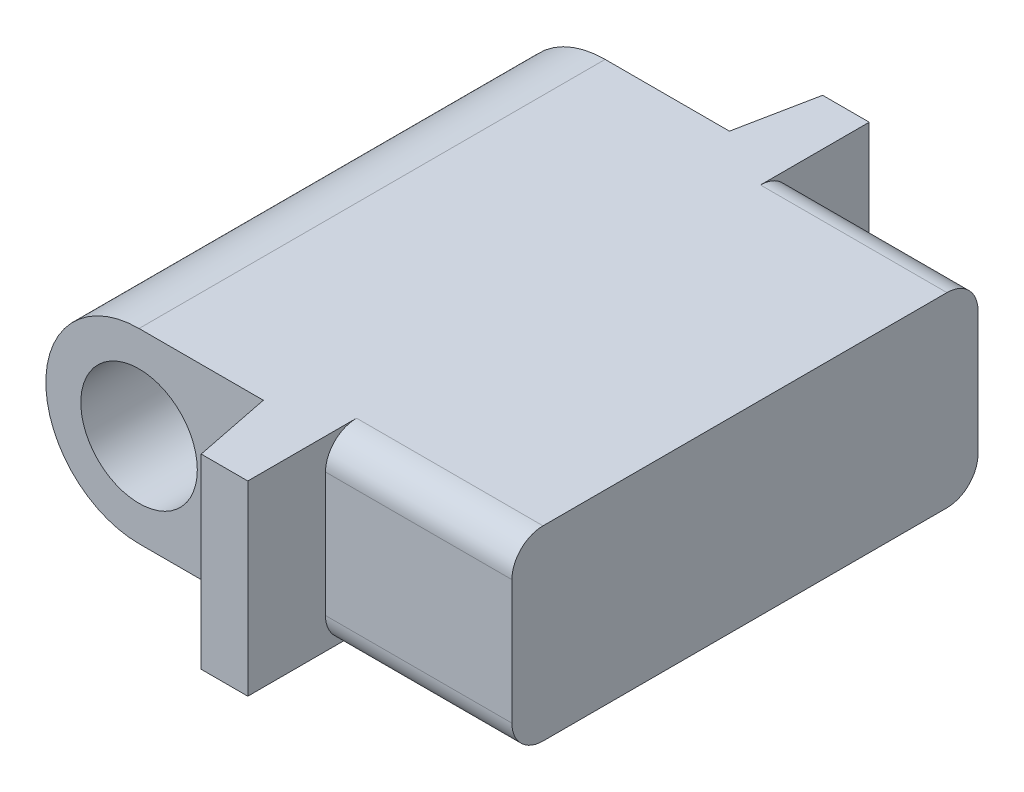
ISO-10303-21;
HEADER;
FILE_DESCRIPTION(('STEP AP214'),'2;1');
FILE_NAME('part.step','',(''),(''),'','','');
FILE_SCHEMA(('AUTOMOTIVE_DESIGN { 1 0 10303 214 1 1 1 1 }'));
ENDSEC;
DATA;
#1=APPLICATION_CONTEXT('core data for automotive mechanical design processes');
#2=APPLICATION_PROTOCOL_DEFINITION('international standard','automotive_design',2000,#1);
#3=PRODUCT_CONTEXT('',#1,'mechanical');
#4=PRODUCT('Part','Part','',(#3));
#5=PRODUCT_RELATED_PRODUCT_CATEGORY('part','',(#4));
#6=PRODUCT_DEFINITION_FORMATION('','',#4);
#7=PRODUCT_DEFINITION_CONTEXT('part definition',#1,'design');
#8=PRODUCT_DEFINITION('design','',#6,#7);
#9=PRODUCT_DEFINITION_SHAPE('','',#8);
#10=(LENGTH_UNIT() NAMED_UNIT(*) SI_UNIT(.MILLI.,.METRE.));
#11=(NAMED_UNIT(*) PLANE_ANGLE_UNIT() SI_UNIT($,.RADIAN.));
#12=(NAMED_UNIT(*) SI_UNIT($,.STERADIAN.) SOLID_ANGLE_UNIT());
#13=UNCERTAINTY_MEASURE_WITH_UNIT(LENGTH_MEASURE(1.E-05),#10,'distance_accuracy_value','');
#14=(GEOMETRIC_REPRESENTATION_CONTEXT(3) GLOBAL_UNCERTAINTY_ASSIGNED_CONTEXT((#13)) GLOBAL_UNIT_ASSIGNED_CONTEXT((#10,
#11,#12)) REPRESENTATION_CONTEXT('',''));
#15=CARTESIAN_POINT('',(0.,0.,0.));
#16=DIRECTION('',(0.,0.,1.));
#17=DIRECTION('',(1.,0.,0.));
#18=AXIS2_PLACEMENT_3D('',#15,#16,#17);
#19=CARTESIAN_POINT('',(0.,0.,19.05));
#20=DIRECTION('',(0.,0.,1.));
#21=DIRECTION('',(1.,0.,0.));
#22=AXIS2_PLACEMENT_3D('',#19,#20,#21);
#23=PLANE('',#22);
#24=CARTESIAN_POINT('',(-11.43,7.62,19.05));
#25=DIRECTION('',(0.,0.,1.));
#26=DIRECTION('',(1.,0.,0.));
#27=AXIS2_PLACEMENT_3D('',#24,#25,#26);
#28=CIRCLE('',#27,4.7625);
#29=CARTESIAN_POINT('',(-6.6675,7.62,19.05));
#30=VERTEX_POINT('',#29);
#31=EDGE_CURVE('E292',#30,#30,#28,.T.);
#32=ORIENTED_EDGE('',*,*,#31,.F.);
#33=EDGE_LOOP('',(#32));
#34=FACE_BOUND('',#33,.T.);
#35=CARTESIAN_POINT('',(-11.43,7.62,19.05));
#36=DIRECTION('',(0.,0.,1.));
#37=DIRECTION('',(1.,0.,0.));
#38=AXIS2_PLACEMENT_3D('',#35,#36,#37);
#39=CIRCLE('',#38,7.62);
#40=CARTESIAN_POINT('',(-11.43,15.24,19.05));
#41=VERTEX_POINT('',#40);
#42=CARTESIAN_POINT('',(-11.43,0.,19.05));
#43=VERTEX_POINT('',#42);
#44=EDGE_CURVE('E176',#41,#43,#39,.T.);
#45=ORIENTED_EDGE('',*,*,#44,.T.);
#46=DIRECTION('',(1.,0.,0.));
#47=VECTOR('',#46,1.);
#48=CARTESIAN_POINT('',(0.,0.,19.05));
#49=LINE('',#48,#47);
#50=CARTESIAN_POINT('',(-1.27000000000001,0.,19.05));
#51=VERTEX_POINT('',#50);
#52=EDGE_CURVE('E180',#43,#51,#49,.T.);
#53=ORIENTED_EDGE('',*,*,#52,.T.);
#54=DIRECTION('',(0.,1.,0.));
#55=VECTOR('',#54,1.);
#56=CARTESIAN_POINT('',(-1.27000000000001,0.,19.05));
#57=LINE('',#56,#55);
#58=CARTESIAN_POINT('',(-1.27000000000001,15.24,19.05));
#59=VERTEX_POINT('',#58);
#60=EDGE_CURVE('E219',#51,#59,#57,.T.);
#61=ORIENTED_EDGE('',*,*,#60,.T.);
#62=DIRECTION('',(1.,0.,0.));
#63=VECTOR('',#62,1.);
#64=CARTESIAN_POINT('',(0.,15.24,19.05));
#65=LINE('',#64,#63);
#66=EDGE_CURVE('E182',#41,#59,#65,.T.);
#67=ORIENTED_EDGE('',*,*,#66,.F.);
#68=EDGE_LOOP('',(#45,#53,#61,#67));
#69=FACE_BOUND('',#68,.T.);
#70=ADVANCED_FACE('F63',(#34,#69),#23,.T.);
#71=CARTESIAN_POINT('',(0.,0.,-19.05));
#72=DIRECTION('',(0.,0.,1.));
#73=DIRECTION('',(1.,0.,0.));
#74=AXIS2_PLACEMENT_3D('',#71,#72,#73);
#75=PLANE('',#74);
#76=CARTESIAN_POINT('',(-11.43,7.62,-19.05));
#77=DIRECTION('',(0.,0.,1.));
#78=DIRECTION('',(1.,0.,0.));
#79=AXIS2_PLACEMENT_3D('',#76,#77,#78);
#80=CIRCLE('',#79,4.7625);
#81=CARTESIAN_POINT('',(-6.6675,7.62,-19.05));
#82=VERTEX_POINT('',#81);
#83=EDGE_CURVE('E187',#82,#82,#80,.T.);
#84=ORIENTED_EDGE('',*,*,#83,.T.);
#85=EDGE_LOOP('',(#84));
#86=FACE_BOUND('',#85,.T.);
#87=DIRECTION('',(1.,0.,0.));
#88=VECTOR('',#87,1.);
#89=CARTESIAN_POINT('',(0.,0.,-19.05));
#90=LINE('',#89,#88);
#91=CARTESIAN_POINT('',(-11.43,0.,-19.05));
#92=VERTEX_POINT('',#91);
#93=CARTESIAN_POINT('',(-1.27000000000001,0.,-19.05));
#94=VERTEX_POINT('',#93);
#95=EDGE_CURVE('E225',#92,#94,#90,.T.);
#96=ORIENTED_EDGE('',*,*,#95,.F.);
#97=CARTESIAN_POINT('',(-11.43,7.62,-19.05));
#98=DIRECTION('',(0.,0.,1.));
#99=DIRECTION('',(1.,0.,0.));
#100=AXIS2_PLACEMENT_3D('',#97,#98,#99);
#101=CIRCLE('',#100,7.62);
#102=CARTESIAN_POINT('',(-11.43,15.24,-19.05));
#103=VERTEX_POINT('',#102);
#104=EDGE_CURVE('E193',#103,#92,#101,.T.);
#105=ORIENTED_EDGE('',*,*,#104,.F.);
#106=DIRECTION('',(1.,0.,0.));
#107=VECTOR('',#106,1.);
#108=CARTESIAN_POINT('',(0.,15.24,-19.05));
#109=LINE('',#108,#107);
#110=CARTESIAN_POINT('',(-1.27000000000001,15.24,-19.05));
#111=VERTEX_POINT('',#110);
#112=EDGE_CURVE('E234',#103,#111,#109,.T.);
#113=ORIENTED_EDGE('',*,*,#112,.T.);
#114=DIRECTION('',(0.,1.,0.));
#115=VECTOR('',#114,1.);
#116=CARTESIAN_POINT('',(-1.27000000000001,0.,-19.05));
#117=LINE('',#116,#115);
#118=EDGE_CURVE('E233',#94,#111,#117,.T.);
#119=ORIENTED_EDGE('',*,*,#118,.F.);
#120=EDGE_LOOP('',(#96,#105,#113,#119));
#121=FACE_BOUND('',#120,.T.);
#122=ADVANCED_FACE('F363',(#86,#121),#75,.F.);
#123=CARTESIAN_POINT('',(0.,0.,0.));
#124=DIRECTION('',(0.,1.,0.));
#125=DIRECTION('',(0.,0.,1.));
#126=AXIS2_PLACEMENT_3D('',#123,#124,#125);
#127=PLANE('',#126);
#128=DIRECTION('',(0.,0.,1.));
#129=VECTOR('',#128,1.);
#130=CARTESIAN_POINT('',(3.81,0.,0.));
#131=LINE('',#130,#129);
#132=CARTESIAN_POINT('',(3.80999999999999,0.,-25.4));
#133=VERTEX_POINT('',#132);
#134=CARTESIAN_POINT('',(3.80999999999999,0.,-16.51));
#135=VERTEX_POINT('',#134);
#136=EDGE_CURVE('E245',#133,#135,#131,.T.);
#137=ORIENTED_EDGE('',*,*,#136,.T.);
#138=DIRECTION('',(1.,0.,0.));
#139=VECTOR('',#138,1.);
#140=CARTESIAN_POINT('',(0.,0.,-16.51));
#141=LINE('',#140,#139);
#142=CARTESIAN_POINT('',(19.05,0.,-16.51));
#143=VERTEX_POINT('',#142);
#144=EDGE_CURVE('E323',#135,#143,#141,.T.);
#145=ORIENTED_EDGE('',*,*,#144,.T.);
#146=DIRECTION('',(0.,0.,-1.));
#147=VECTOR('',#146,1.);
#148=CARTESIAN_POINT('',(19.05,0.,25.4));
#149=LINE('',#148,#147);
#150=CARTESIAN_POINT('',(19.05,0.,16.51));
#151=VERTEX_POINT('',#150);
#152=EDGE_CURVE('E280',#151,#143,#149,.T.);
#153=ORIENTED_EDGE('',*,*,#152,.F.);
#154=DIRECTION('',(1.,0.,0.));
#155=VECTOR('',#154,1.);
#156=CARTESIAN_POINT('',(3.80999999999998,0.,16.51));
#157=LINE('',#156,#155);
#158=CARTESIAN_POINT('',(3.80999999999999,0.,16.51));
#159=VERTEX_POINT('',#158);
#160=EDGE_CURVE('E319',#151,#159,#157,.F.);
#161=ORIENTED_EDGE('',*,*,#160,.T.);
#162=DIRECTION('',(0.,0.,-1.));
#163=VECTOR('',#162,1.);
#164=CARTESIAN_POINT('',(3.80999999999999,0.,0.));
#165=LINE('',#164,#163);
#166=CARTESIAN_POINT('',(3.80999999999999,0.,25.4));
#167=VERTEX_POINT('',#166);
#168=EDGE_CURVE('E347',#167,#159,#165,.T.);
#169=ORIENTED_EDGE('',*,*,#168,.F.);
#170=DIRECTION('',(1.,0.,0.));
#171=VECTOR('',#170,1.);
#172=CARTESIAN_POINT('',(19.05,0.,25.4));
#173=LINE('',#172,#171);
#174=CARTESIAN_POINT('',(0.,0.,25.4));
#175=VERTEX_POINT('',#174);
#176=EDGE_CURVE('E256',#175,#167,#173,.T.);
#177=ORIENTED_EDGE('',*,*,#176,.F.);
#178=DIRECTION('',(0.196116135138184,0.,0.98058067569092));
#179=VECTOR('',#178,1.);
#180=CARTESIAN_POINT('',(-4.8846153846154,0.,0.97692307692308));
#181=LINE('',#180,#179);
#182=EDGE_CURVE('E202',#51,#175,#181,.T.);
#183=ORIENTED_EDGE('',*,*,#182,.F.);
#184=ORIENTED_EDGE('',*,*,#52,.F.);
#185=DIRECTION('',(0.,0.,1.));
#186=VECTOR('',#185,1.);
#187=CARTESIAN_POINT('',(-11.43,0.,-25.4));
#188=LINE('',#187,#186);
#189=EDGE_CURVE('E190',#92,#43,#188,.T.);
#190=ORIENTED_EDGE('',*,*,#189,.F.);
#191=ORIENTED_EDGE('',*,*,#95,.T.);
#192=DIRECTION('',(0.196116135138184,0.,-0.98058067569092));
#193=VECTOR('',#192,1.);
#194=CARTESIAN_POINT('',(-4.88461538461539,0.,-0.976923076923078));
#195=LINE('',#194,#193);
#196=CARTESIAN_POINT('',(0.,0.,-25.4));
#197=VERTEX_POINT('',#196);
#198=EDGE_CURVE('E228',#94,#197,#195,.T.);
#199=ORIENTED_EDGE('',*,*,#198,.T.);
#200=DIRECTION('',(-1.,0.,0.));
#201=VECTOR('',#200,1.);
#202=CARTESIAN_POINT('',(19.05,0.,-25.4));
#203=LINE('',#202,#201);
#204=EDGE_CURVE('E269',#133,#197,#203,.T.);
#205=ORIENTED_EDGE('',*,*,#204,.F.);
#206=EDGE_LOOP('',(#137,#145,#153,#161,#169,#177,#183,#184,#190,#191,#199,#205));
#207=FACE_BOUND('',#206,.T.);
#208=ADVANCED_FACE('F200',(#207),#127,.F.);
#209=CARTESIAN_POINT('',(0.,15.24,0.));
#210=DIRECTION('',(0.,1.,0.));
#211=DIRECTION('',(0.,0.,1.));
#212=AXIS2_PLACEMENT_3D('',#209,#210,#211);
#213=PLANE('',#212);
#214=DIRECTION('',(0.,0.,-1.));
#215=VECTOR('',#214,1.);
#216=CARTESIAN_POINT('',(19.05,15.24,25.4));
#217=LINE('',#216,#215);
#218=CARTESIAN_POINT('',(19.05,15.24,16.51));
#219=VERTEX_POINT('',#218);
#220=CARTESIAN_POINT('',(19.05,15.24,-16.51));
#221=VERTEX_POINT('',#220);
#222=EDGE_CURVE('E268',#219,#221,#217,.T.);
#223=ORIENTED_EDGE('',*,*,#222,.T.);
#224=DIRECTION('',(1.,0.,0.));
#225=VECTOR('',#224,1.);
#226=CARTESIAN_POINT('',(3.80999999999999,15.24,-16.51));
#227=LINE('',#226,#225);
#228=CARTESIAN_POINT('',(3.80999999999999,15.24,-16.51));
#229=VERTEX_POINT('',#228);
#230=EDGE_CURVE('E315',#221,#229,#227,.F.);
#231=ORIENTED_EDGE('',*,*,#230,.T.);
#232=DIRECTION('',(0.,0.,1.));
#233=VECTOR('',#232,1.);
#234=CARTESIAN_POINT('',(3.81,15.24,0.));
#235=LINE('',#234,#233);
#236=CARTESIAN_POINT('',(3.80999999999999,15.24,-25.4));
#237=VERTEX_POINT('',#236);
#238=EDGE_CURVE('E249',#237,#229,#235,.T.);
#239=ORIENTED_EDGE('',*,*,#238,.F.);
#240=DIRECTION('',(-1.,0.,0.));
#241=VECTOR('',#240,1.);
#242=CARTESIAN_POINT('',(19.05,15.24,-25.4));
#243=LINE('',#242,#241);
#244=CARTESIAN_POINT('',(0.,15.24,-25.4));
#245=VERTEX_POINT('',#244);
#246=EDGE_CURVE('E273',#237,#245,#243,.T.);
#247=ORIENTED_EDGE('',*,*,#246,.T.);
#248=DIRECTION('',(0.196116135138184,0.,-0.98058067569092));
#249=VECTOR('',#248,1.);
#250=CARTESIAN_POINT('',(-4.88461538461539,15.24,-0.976923076923078));
#251=LINE('',#250,#249);
#252=EDGE_CURVE('E229',#111,#245,#251,.T.);
#253=ORIENTED_EDGE('',*,*,#252,.F.);
#254=ORIENTED_EDGE('',*,*,#112,.F.);
#255=DIRECTION('',(0.,0.,1.));
#256=VECTOR('',#255,1.);
#257=CARTESIAN_POINT('',(-11.43,15.24,-25.4));
#258=LINE('',#257,#256);
#259=EDGE_CURVE('E186',#103,#41,#258,.T.);
#260=ORIENTED_EDGE('',*,*,#259,.T.);
#261=ORIENTED_EDGE('',*,*,#66,.T.);
#262=DIRECTION('',(0.196116135138184,0.,0.98058067569092));
#263=VECTOR('',#262,1.);
#264=CARTESIAN_POINT('',(-4.8846153846154,15.24,0.97692307692308));
#265=LINE('',#264,#263);
#266=CARTESIAN_POINT('',(0.,15.24,25.4));
#267=VERTEX_POINT('',#266);
#268=EDGE_CURVE('E204',#59,#267,#265,.T.);
#269=ORIENTED_EDGE('',*,*,#268,.T.);
#270=DIRECTION('',(1.,0.,0.));
#271=VECTOR('',#270,1.);
#272=CARTESIAN_POINT('',(19.05,15.24,25.4));
#273=LINE('',#272,#271);
#274=CARTESIAN_POINT('',(3.80999999999999,15.24,25.4));
#275=VERTEX_POINT('',#274);
#276=EDGE_CURVE('E264',#267,#275,#273,.T.);
#277=ORIENTED_EDGE('',*,*,#276,.T.);
#278=DIRECTION('',(0.,0.,-1.));
#279=VECTOR('',#278,1.);
#280=CARTESIAN_POINT('',(3.80999999999999,15.24,0.));
#281=LINE('',#280,#279);
#282=CARTESIAN_POINT('',(3.80999999999999,15.24,16.51));
#283=VERTEX_POINT('',#282);
#284=EDGE_CURVE('E222',#275,#283,#281,.T.);
#285=ORIENTED_EDGE('',*,*,#284,.T.);
#286=DIRECTION('',(1.,0.,0.));
#287=VECTOR('',#286,1.);
#288=CARTESIAN_POINT('',(0.,15.24,16.51));
#289=LINE('',#288,#287);
#290=EDGE_CURVE('E311',#283,#219,#289,.T.);
#291=ORIENTED_EDGE('',*,*,#290,.T.);
#292=EDGE_LOOP('',(#223,#231,#239,#247,#253,#254,#260,#261,#269,#277,#285,#291));
#293=FACE_BOUND('',#292,.T.);
#294=ADVANCED_FACE('F388',(#293),#213,.T.);
#295=CARTESIAN_POINT('',(19.05,15.24,25.4));
#296=DIRECTION('',(0.,0.,-1.));
#297=DIRECTION('',(-1.,0.,0.));
#298=AXIS2_PLACEMENT_3D('',#295,#296,#297);
#299=PLANE('',#298);
#300=DIRECTION('',(0.,1.,0.));
#301=VECTOR('',#300,1.);
#302=CARTESIAN_POINT('',(0.,0.,25.4));
#303=LINE('',#302,#301);
#304=EDGE_CURVE('E208',#175,#267,#303,.T.);
#305=ORIENTED_EDGE('',*,*,#304,.F.);
#306=ORIENTED_EDGE('',*,*,#176,.T.);
#307=DIRECTION('',(0.,1.,0.));
#308=VECTOR('',#307,1.);
#309=CARTESIAN_POINT('',(3.80999999999999,0.,25.4));
#310=LINE('',#309,#308);
#311=EDGE_CURVE('E213',#167,#275,#310,.T.);
#312=ORIENTED_EDGE('',*,*,#311,.T.);
#313=ORIENTED_EDGE('',*,*,#276,.F.);
#314=EDGE_LOOP('',(#305,#306,#312,#313));
#315=FACE_BOUND('',#314,.T.);
#316=ADVANCED_FACE('F391',(#315),#299,.F.);
#317=CARTESIAN_POINT('',(19.05,15.24,25.4));
#318=DIRECTION('',(-1.,0.,0.));
#319=DIRECTION('',(0.,0.,1.));
#320=AXIS2_PLACEMENT_3D('',#317,#318,#319);
#321=PLANE('',#320);
#322=DIRECTION('',(0.,1.,0.));
#323=VECTOR('',#322,1.);
#324=CARTESIAN_POINT('',(19.05,0.,-19.05));
#325=LINE('',#324,#323);
#326=CARTESIAN_POINT('',(19.05,2.54,-19.05));
#327=VERTEX_POINT('',#326);
#328=CARTESIAN_POINT('',(19.05,12.7,-19.05));
#329=VERTEX_POINT('',#328);
#330=EDGE_CURVE('E257',#327,#329,#325,.T.);
#331=ORIENTED_EDGE('',*,*,#330,.T.);
#332=CARTESIAN_POINT('',(19.05,12.7,-16.51));
#333=DIRECTION('',(-1.,0.,0.));
#334=DIRECTION('',(0.,0.,1.));
#335=AXIS2_PLACEMENT_3D('',#332,#333,#334);
#336=CIRCLE('',#335,2.54);
#337=EDGE_CURVE('E308',#329,#221,#336,.F.);
#338=ORIENTED_EDGE('',*,*,#337,.T.);
#339=ORIENTED_EDGE('',*,*,#222,.F.);
#340=CARTESIAN_POINT('',(19.05,12.7,16.51));
#341=DIRECTION('',(-1.,0.,0.));
#342=DIRECTION('',(0.,0.,1.));
#343=AXIS2_PLACEMENT_3D('',#340,#341,#342);
#344=CIRCLE('',#343,2.54);
#345=CARTESIAN_POINT('',(19.05,12.7,19.05));
#346=VERTEX_POINT('',#345);
#347=EDGE_CURVE('E299',#219,#346,#344,.F.);
#348=ORIENTED_EDGE('',*,*,#347,.T.);
#349=DIRECTION('',(0.,1.,0.));
#350=VECTOR('',#349,1.);
#351=CARTESIAN_POINT('',(19.05,0.,19.05));
#352=LINE('',#351,#350);
#353=CARTESIAN_POINT('',(19.05,2.54,19.05));
#354=VERTEX_POINT('',#353);
#355=EDGE_CURVE('E342',#354,#346,#352,.T.);
#356=ORIENTED_EDGE('',*,*,#355,.F.);
#357=CARTESIAN_POINT('',(19.05,2.54,16.51));
#358=DIRECTION('',(-1.,0.,0.));
#359=DIRECTION('',(0.,0.,1.));
#360=AXIS2_PLACEMENT_3D('',#357,#358,#359);
#361=CIRCLE('',#360,2.54);
#362=EDGE_CURVE('E302',#354,#151,#361,.F.);
#363=ORIENTED_EDGE('',*,*,#362,.T.);
#364=ORIENTED_EDGE('',*,*,#152,.T.);
#365=CARTESIAN_POINT('',(19.05,2.54,-16.51));
#366=DIRECTION('',(-1.,0.,0.));
#367=DIRECTION('',(0.,0.,1.));
#368=AXIS2_PLACEMENT_3D('',#365,#366,#367);
#369=CIRCLE('',#368,2.54);
#370=EDGE_CURVE('E305',#143,#327,#369,.F.);
#371=ORIENTED_EDGE('',*,*,#370,.T.);
#372=EDGE_LOOP('',(#331,#338,#339,#348,#356,#363,#364,#371));
#373=FACE_BOUND('',#372,.T.);
#374=ADVANCED_FACE('F396',(#373),#321,.F.);
#375=CARTESIAN_POINT('',(19.05,15.24,-25.4));
#376=DIRECTION('',(0.,0.,1.));
#377=DIRECTION('',(1.,0.,0.));
#378=AXIS2_PLACEMENT_3D('',#375,#376,#377);
#379=PLANE('',#378);
#380=ORIENTED_EDGE('',*,*,#204,.T.);
#381=DIRECTION('',(0.,1.,0.));
#382=VECTOR('',#381,1.);
#383=CARTESIAN_POINT('',(0.,0.,-25.4));
#384=LINE('',#383,#382);
#385=EDGE_CURVE('E217',#197,#245,#384,.T.);
#386=ORIENTED_EDGE('',*,*,#385,.T.);
#387=ORIENTED_EDGE('',*,*,#246,.F.);
#388=DIRECTION('',(0.,1.,0.));
#389=VECTOR('',#388,1.);
#390=CARTESIAN_POINT('',(3.80999999999999,0.,-25.4));
#391=LINE('',#390,#389);
#392=EDGE_CURVE('E253',#133,#237,#391,.T.);
#393=ORIENTED_EDGE('',*,*,#392,.F.);
#394=EDGE_LOOP('',(#380,#386,#387,#393));
#395=FACE_BOUND('',#394,.T.);
#396=ADVANCED_FACE('F386',(#395),#379,.F.);
#397=CARTESIAN_POINT('',(3.81,0.,0.));
#398=DIRECTION('',(-1.,0.,0.));
#399=DIRECTION('',(0.,0.,1.));
#400=AXIS2_PLACEMENT_3D('',#397,#398,#399);
#401=PLANE('',#400);
#402=ORIENTED_EDGE('',*,*,#238,.T.);
#403=CARTESIAN_POINT('',(3.80999999999999,12.7,-16.51));
#404=DIRECTION('',(-1.,0.,0.));
#405=DIRECTION('',(0.,0.,1.));
#406=AXIS2_PLACEMENT_3D('',#403,#404,#405);
#407=CIRCLE('',#406,2.54);
#408=CARTESIAN_POINT('',(3.80999999999999,12.7,-19.05));
#409=VERTEX_POINT('',#408);
#410=EDGE_CURVE('E333',#229,#409,#407,.T.);
#411=ORIENTED_EDGE('',*,*,#410,.T.);
#412=DIRECTION('',(0.,1.,0.));
#413=VECTOR('',#412,1.);
#414=CARTESIAN_POINT('',(3.80999999999999,0.,-19.05));
#415=LINE('',#414,#413);
#416=CARTESIAN_POINT('',(3.80999999999999,2.54,-19.05));
#417=VERTEX_POINT('',#416);
#418=EDGE_CURVE('E248',#417,#409,#415,.T.);
#419=ORIENTED_EDGE('',*,*,#418,.F.);
#420=CARTESIAN_POINT('',(3.80999999999999,2.54,-16.51));
#421=DIRECTION('',(-1.,0.,0.));
#422=DIRECTION('',(0.,0.,1.));
#423=AXIS2_PLACEMENT_3D('',#420,#421,#422);
#424=CIRCLE('',#423,2.54);
#425=EDGE_CURVE('E336',#417,#135,#424,.T.);
#426=ORIENTED_EDGE('',*,*,#425,.T.);
#427=ORIENTED_EDGE('',*,*,#136,.F.);
#428=ORIENTED_EDGE('',*,*,#392,.T.);
#429=EDGE_LOOP('',(#402,#411,#419,#426,#427,#428));
#430=FACE_BOUND('',#429,.T.);
#431=ADVANCED_FACE('F382',(#430),#401,.F.);
#432=CARTESIAN_POINT('',(0.,0.,-19.05));
#433=DIRECTION('',(0.,0.,1.));
#434=DIRECTION('',(1.,0.,0.));
#435=AXIS2_PLACEMENT_3D('',#432,#433,#434);
#436=PLANE('',#435);
#437=ORIENTED_EDGE('',*,*,#418,.T.);
#438=DIRECTION('',(1.,0.,0.));
#439=VECTOR('',#438,1.);
#440=CARTESIAN_POINT('',(19.05,12.7,-19.05));
#441=LINE('',#440,#439);
#442=EDGE_CURVE('E295',#409,#329,#441,.T.);
#443=ORIENTED_EDGE('',*,*,#442,.T.);
#444=ORIENTED_EDGE('',*,*,#330,.F.);
#445=DIRECTION('',(1.,0.,0.));
#446=VECTOR('',#445,1.);
#447=CARTESIAN_POINT('',(0.,2.54,-19.05));
#448=LINE('',#447,#446);
#449=EDGE_CURVE('E197',#327,#417,#448,.F.);
#450=ORIENTED_EDGE('',*,*,#449,.T.);
#451=EDGE_LOOP('',(#437,#443,#444,#450));
#452=FACE_BOUND('',#451,.T.);
#453=ADVANCED_FACE('F378',(#452),#436,.F.);
#454=CARTESIAN_POINT('',(3.80999999999999,0.,0.));
#455=DIRECTION('',(1.,0.,0.));
#456=DIRECTION('',(0.,0.,-1.));
#457=AXIS2_PLACEMENT_3D('',#454,#455,#456);
#458=PLANE('',#457);
#459=ORIENTED_EDGE('',*,*,#284,.F.);
#460=ORIENTED_EDGE('',*,*,#311,.F.);
#461=ORIENTED_EDGE('',*,*,#168,.T.);
#462=CARTESIAN_POINT('',(3.80999999999999,2.54,16.51));
#463=DIRECTION('',(1.,0.,0.));
#464=DIRECTION('',(0.,0.,-1.));
#465=AXIS2_PLACEMENT_3D('',#462,#463,#464);
#466=CIRCLE('',#465,2.54);
#467=CARTESIAN_POINT('',(3.80999999999999,2.54,19.05));
#468=VERTEX_POINT('',#467);
#469=EDGE_CURVE('E72',#159,#468,#466,.F.);
#470=ORIENTED_EDGE('',*,*,#469,.T.);
#471=DIRECTION('',(0.,1.,0.));
#472=VECTOR('',#471,1.);
#473=CARTESIAN_POINT('',(3.80999999999999,0.,19.05));
#474=LINE('',#473,#472);
#475=CARTESIAN_POINT('',(3.80999999999999,12.7,19.05));
#476=VERTEX_POINT('',#475);
#477=EDGE_CURVE('E252',#468,#476,#474,.T.);
#478=ORIENTED_EDGE('',*,*,#477,.T.);
#479=CARTESIAN_POINT('',(3.80999999999999,12.7,16.51));
#480=DIRECTION('',(1.,0.,0.));
#481=DIRECTION('',(0.,0.,-1.));
#482=AXIS2_PLACEMENT_3D('',#479,#480,#481);
#483=CIRCLE('',#482,2.54);
#484=EDGE_CURVE('E12',#476,#283,#483,.F.);
#485=ORIENTED_EDGE('',*,*,#484,.T.);
#486=EDGE_LOOP('',(#459,#460,#461,#470,#478,#485));
#487=FACE_BOUND('',#486,.T.);
#488=ADVANCED_FACE('F381',(#487),#458,.T.);
#489=CARTESIAN_POINT('',(0.,0.,19.05));
#490=DIRECTION('',(0.,0.,1.));
#491=DIRECTION('',(1.,0.,0.));
#492=AXIS2_PLACEMENT_3D('',#489,#490,#491);
#493=PLANE('',#492);
#494=ORIENTED_EDGE('',*,*,#477,.F.);
#495=DIRECTION('',(1.,0.,0.));
#496=VECTOR('',#495,1.);
#497=CARTESIAN_POINT('',(19.05,2.54,19.05));
#498=LINE('',#497,#496);
#499=EDGE_CURVE('E329',#468,#354,#498,.T.);
#500=ORIENTED_EDGE('',*,*,#499,.T.);
#501=ORIENTED_EDGE('',*,*,#355,.T.);
#502=DIRECTION('',(1.,0.,0.));
#503=VECTOR('',#502,1.);
#504=CARTESIAN_POINT('',(0.,12.7,19.05));
#505=LINE('',#504,#503);
#506=EDGE_CURVE('E79',#346,#476,#505,.F.);
#507=ORIENTED_EDGE('',*,*,#506,.T.);
#508=EDGE_LOOP('',(#494,#500,#501,#507));
#509=FACE_BOUND('',#508,.T.);
#510=ADVANCED_FACE('F421',(#509),#493,.T.);
#511=CARTESIAN_POINT('',(-4.8846153846154,0.,0.97692307692308));
#512=DIRECTION('',(-0.98058067569092,0.,0.196116135138184));
#513=DIRECTION('',(0.196116135138184,0.,0.98058067569092));
#514=AXIS2_PLACEMENT_3D('',#511,#512,#513);
#515=PLANE('',#514);
#516=ORIENTED_EDGE('',*,*,#268,.F.);
#517=ORIENTED_EDGE('',*,*,#60,.F.);
#518=ORIENTED_EDGE('',*,*,#182,.T.);
#519=ORIENTED_EDGE('',*,*,#304,.T.);
#520=EDGE_LOOP('',(#516,#517,#518,#519));
#521=FACE_BOUND('',#520,.T.);
#522=ADVANCED_FACE('F372',(#521),#515,.T.);
#523=CARTESIAN_POINT('',(-4.88461538461539,0.,-0.976923076923078));
#524=DIRECTION('',(0.98058067569092,0.,0.196116135138184));
#525=DIRECTION('',(0.196116135138184,0.,-0.98058067569092));
#526=AXIS2_PLACEMENT_3D('',#523,#524,#525);
#527=PLANE('',#526);
#528=ORIENTED_EDGE('',*,*,#252,.T.);
#529=ORIENTED_EDGE('',*,*,#385,.F.);
#530=ORIENTED_EDGE('',*,*,#198,.F.);
#531=ORIENTED_EDGE('',*,*,#118,.T.);
#532=EDGE_LOOP('',(#528,#529,#530,#531));
#533=FACE_BOUND('',#532,.T.);
#534=ADVANCED_FACE('F374',(#533),#527,.F.);
#535=CARTESIAN_POINT('',(-11.43,7.62,-25.4));
#536=DIRECTION('',(0.,0.,1.));
#537=DIRECTION('',(1.,0.,0.));
#538=AXIS2_PLACEMENT_3D('',#535,#536,#537);
#539=CYLINDRICAL_SURFACE('',#538,7.62);
#540=ORIENTED_EDGE('',*,*,#104,.T.);
#541=ORIENTED_EDGE('',*,*,#189,.T.);
#542=ORIENTED_EDGE('',*,*,#44,.F.);
#543=ORIENTED_EDGE('',*,*,#259,.F.);
#544=EDGE_LOOP('',(#540,#541,#542,#543));
#545=FACE_BOUND('',#544,.T.);
#546=ADVANCED_FACE('F191',(#545),#539,.T.);
#547=CARTESIAN_POINT('',(-11.43,7.62,-25.4));
#548=DIRECTION('',(0.,0.,1.));
#549=DIRECTION('',(1.,0.,0.));
#550=AXIS2_PLACEMENT_3D('',#547,#548,#549);
#551=CYLINDRICAL_SURFACE('',#550,4.7625);
#552=ORIENTED_EDGE('',*,*,#31,.T.);
#553=EDGE_LOOP('',(#552));
#554=FACE_BOUND('',#553,.T.);
#555=ORIENTED_EDGE('',*,*,#83,.F.);
#556=EDGE_LOOP('',(#555));
#557=FACE_BOUND('',#556,.T.);
#558=ADVANCED_FACE('F359',(#554,#557),#551,.F.);
#559=CARTESIAN_POINT('',(0.,12.7,-16.51));
#560=DIRECTION('',(-1.,0.,0.));
#561=DIRECTION('',(0.,0.,1.));
#562=AXIS2_PLACEMENT_3D('',#559,#560,#561);
#563=CYLINDRICAL_SURFACE('',#562,2.54);
#564=ORIENTED_EDGE('',*,*,#410,.F.);
#565=ORIENTED_EDGE('',*,*,#230,.F.);
#566=ORIENTED_EDGE('',*,*,#337,.F.);
#567=ORIENTED_EDGE('',*,*,#442,.F.);
#568=EDGE_LOOP('',(#564,#565,#566,#567));
#569=FACE_BOUND('',#568,.T.);
#570=ADVANCED_FACE('F404',(#569),#563,.T.);
#571=CARTESIAN_POINT('',(0.,2.54,-16.51));
#572=DIRECTION('',(1.,0.,0.));
#573=DIRECTION('',(0.,0.,-1.));
#574=AXIS2_PLACEMENT_3D('',#571,#572,#573);
#575=CYLINDRICAL_SURFACE('',#574,2.54);
#576=ORIENTED_EDGE('',*,*,#425,.F.);
#577=ORIENTED_EDGE('',*,*,#449,.F.);
#578=ORIENTED_EDGE('',*,*,#370,.F.);
#579=ORIENTED_EDGE('',*,*,#144,.F.);
#580=EDGE_LOOP('',(#576,#577,#578,#579));
#581=FACE_BOUND('',#580,.T.);
#582=ADVANCED_FACE('F407',(#581),#575,.T.);
#583=CARTESIAN_POINT('',(0.,2.54,16.51));
#584=DIRECTION('',(-1.,0.,0.));
#585=DIRECTION('',(0.,0.,1.));
#586=AXIS2_PLACEMENT_3D('',#583,#584,#585);
#587=CYLINDRICAL_SURFACE('',#586,2.54);
#588=ORIENTED_EDGE('',*,*,#469,.F.);
#589=ORIENTED_EDGE('',*,*,#160,.F.);
#590=ORIENTED_EDGE('',*,*,#362,.F.);
#591=ORIENTED_EDGE('',*,*,#499,.F.);
#592=EDGE_LOOP('',(#588,#589,#590,#591));
#593=FACE_BOUND('',#592,.T.);
#594=ADVANCED_FACE('F410',(#593),#587,.T.);
#595=CARTESIAN_POINT('',(0.,12.7,16.51));
#596=DIRECTION('',(1.,0.,0.));
#597=DIRECTION('',(0.,0.,-1.));
#598=AXIS2_PLACEMENT_3D('',#595,#596,#597);
#599=CYLINDRICAL_SURFACE('',#598,2.54);
#600=ORIENTED_EDGE('',*,*,#484,.F.);
#601=ORIENTED_EDGE('',*,*,#506,.F.);
#602=ORIENTED_EDGE('',*,*,#347,.F.);
#603=ORIENTED_EDGE('',*,*,#290,.F.);
#604=EDGE_LOOP('',(#600,#601,#602,#603));
#605=FACE_BOUND('',#604,.T.);
#606=ADVANCED_FACE('F65',(#605),#599,.T.);
#607=CLOSED_SHELL('',(#70,#122,#208,#294,#316,#374,#396,#431,#453,#488,#510,#522,#534,#546,#558,
#570,#582,#594,#606));
#608=MANIFOLD_SOLID_BREP('B2',#607);
#609=ADVANCED_BREP_SHAPE_REPRESENTATION('',(#18,#608),#14);
#610=SHAPE_DEFINITION_REPRESENTATION(#9,#609);
ENDSEC;
END-ISO-10303-21;
